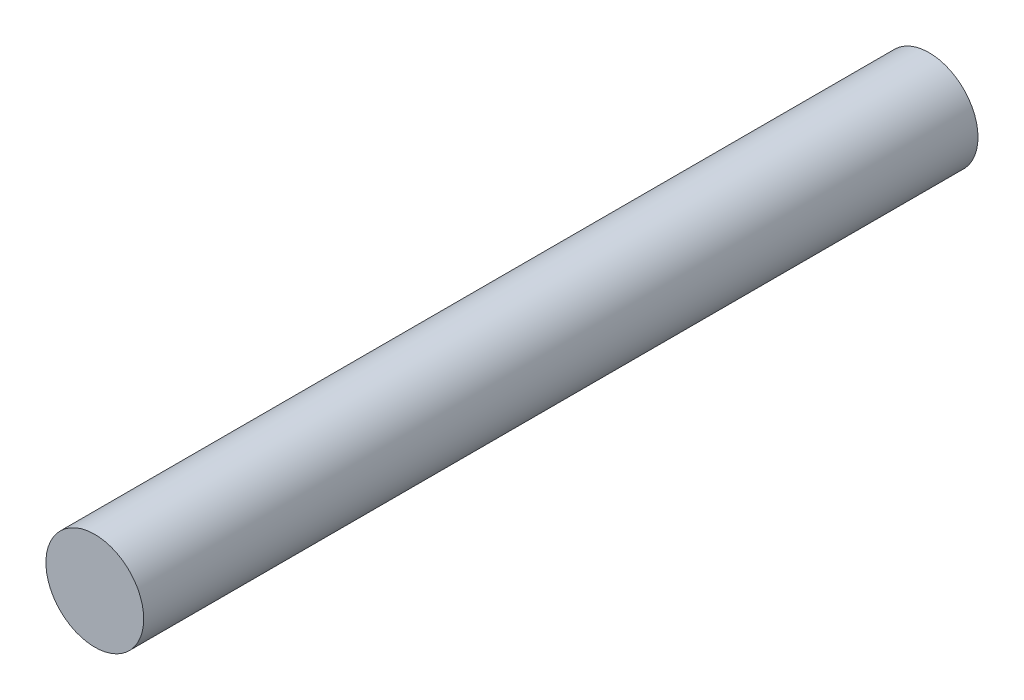
ISO-10303-21;
HEADER;
FILE_DESCRIPTION(('STEP AP214'),'2;1');
FILE_NAME('part.step','',(''),(''),'','','');
FILE_SCHEMA(('AUTOMOTIVE_DESIGN { 1 0 10303 214 1 1 1 1 }'));
ENDSEC;
DATA;
#1=APPLICATION_CONTEXT('core data for automotive mechanical design processes');
#2=APPLICATION_PROTOCOL_DEFINITION('international standard','automotive_design',2000,#1);
#3=PRODUCT_CONTEXT('',#1,'mechanical');
#4=PRODUCT('Part','Part','',(#3));
#5=PRODUCT_RELATED_PRODUCT_CATEGORY('part','',(#4));
#6=PRODUCT_DEFINITION_FORMATION('','',#4);
#7=PRODUCT_DEFINITION_CONTEXT('part definition',#1,'design');
#8=PRODUCT_DEFINITION('design','',#6,#7);
#9=PRODUCT_DEFINITION_SHAPE('','',#8);
#10=(LENGTH_UNIT() NAMED_UNIT(*) SI_UNIT(.MILLI.,.METRE.));
#11=(NAMED_UNIT(*) PLANE_ANGLE_UNIT() SI_UNIT($,.RADIAN.));
#12=(NAMED_UNIT(*) SI_UNIT($,.STERADIAN.) SOLID_ANGLE_UNIT());
#13=UNCERTAINTY_MEASURE_WITH_UNIT(LENGTH_MEASURE(1.E-05),#10,'distance_accuracy_value','');
#14=(GEOMETRIC_REPRESENTATION_CONTEXT(3) GLOBAL_UNCERTAINTY_ASSIGNED_CONTEXT((#13)) GLOBAL_UNIT_ASSIGNED_CONTEXT((#10,
#11,#12)) REPRESENTATION_CONTEXT('',''));
#15=CARTESIAN_POINT('',(0.,0.,0.));
#16=DIRECTION('',(0.,0.,1.));
#17=DIRECTION('',(1.,0.,0.));
#18=AXIS2_PLACEMENT_3D('',#15,#16,#17);
#19=CARTESIAN_POINT('',(0.,0.,17.0673954951514));
#20=DIRECTION('',(0.,0.,-1.));
#21=DIRECTION('',(-1.,0.,0.));
#22=AXIS2_PLACEMENT_3D('',#19,#20,#21);
#23=CYLINDRICAL_SURFACE('',#22,0.999999999999999);
#24=CARTESIAN_POINT('',(0.,0.,17.0673954951514));
#25=DIRECTION('',(0.,0.,1.));
#26=DIRECTION('',(1.,0.,0.));
#27=AXIS2_PLACEMENT_3D('',#24,#25,#26);
#28=CIRCLE('',#27,0.999999999999999);
#29=CARTESIAN_POINT('',(0.999999999999999,0.,17.0673954951514));
#30=VERTEX_POINT('',#29);
#31=EDGE_CURVE('E10',#30,#30,#28,.T.);
#32=ORIENTED_EDGE('',*,*,#31,.F.);
#33=EDGE_LOOP('',(#32));
#34=FACE_BOUND('',#33,.T.);
#35=CARTESIAN_POINT('',(0.,0.,0.));
#36=DIRECTION('',(0.,0.,1.));
#37=DIRECTION('',(1.,0.,0.));
#38=AXIS2_PLACEMENT_3D('',#35,#36,#37);
#39=CIRCLE('',#38,0.999999999999999);
#40=CARTESIAN_POINT('',(0.999999999999999,0.,0.));
#41=VERTEX_POINT('',#40);
#42=EDGE_CURVE('E38',#41,#41,#39,.T.);
#43=ORIENTED_EDGE('',*,*,#42,.T.);
#44=EDGE_LOOP('',(#43));
#45=FACE_BOUND('',#44,.T.);
#46=ADVANCED_FACE('F35',(#34,#45),#23,.T.);
#47=CARTESIAN_POINT('',(0.,0.,17.0673954951514));
#48=DIRECTION('',(0.,0.,1.));
#49=DIRECTION('',(1.,0.,0.));
#50=AXIS2_PLACEMENT_3D('',#47,#48,#49);
#51=PLANE('',#50);
#52=ORIENTED_EDGE('',*,*,#31,.T.);
#53=EDGE_LOOP('',(#52));
#54=FACE_BOUND('',#53,.T.);
#55=ADVANCED_FACE('F50',(#54),#51,.T.);
#56=CARTESIAN_POINT('',(0.,0.,0.));
#57=DIRECTION('',(0.,0.,1.));
#58=DIRECTION('',(1.,0.,0.));
#59=AXIS2_PLACEMENT_3D('',#56,#57,#58);
#60=PLANE('',#59);
#61=ORIENTED_EDGE('',*,*,#42,.F.);
#62=EDGE_LOOP('',(#61));
#63=FACE_BOUND('',#62,.T.);
#64=ADVANCED_FACE('F48',(#63),#60,.F.);
#65=CLOSED_SHELL('',(#46,#55,#64));
#66=MANIFOLD_SOLID_BREP('B2',#65);
#67=ADVANCED_BREP_SHAPE_REPRESENTATION('',(#18,#66),#14);
#68=SHAPE_DEFINITION_REPRESENTATION(#9,#67);
ENDSEC;
END-ISO-10303-21;
